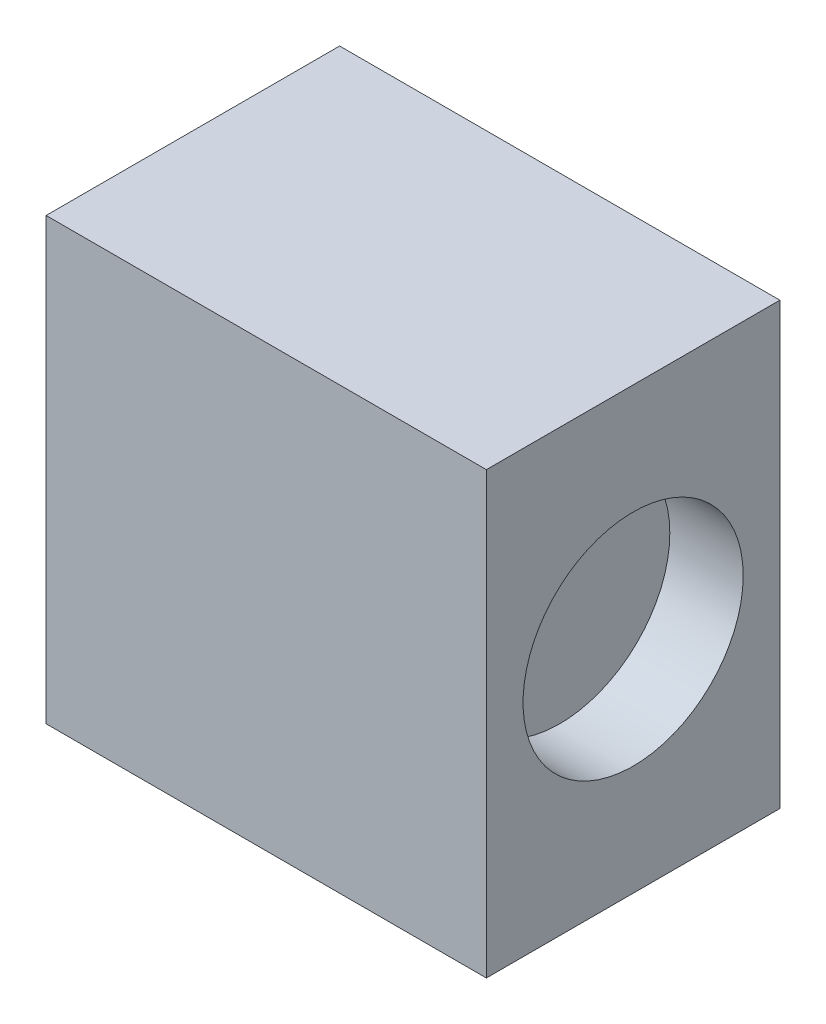
ISO-10303-21;
HEADER;
FILE_DESCRIPTION(('STEP AP214'),'2;1');
FILE_NAME('part.step','',(''),(''),'','','');
FILE_SCHEMA(('AUTOMOTIVE_DESIGN { 1 0 10303 214 1 1 1 1 }'));
ENDSEC;
DATA;
#1=APPLICATION_CONTEXT('core data for automotive mechanical design processes');
#2=APPLICATION_PROTOCOL_DEFINITION('international standard','automotive_design',2000,#1);
#3=PRODUCT_CONTEXT('',#1,'mechanical');
#4=PRODUCT('Part','Part','',(#3));
#5=PRODUCT_RELATED_PRODUCT_CATEGORY('part','',(#4));
#6=PRODUCT_DEFINITION_FORMATION('','',#4);
#7=PRODUCT_DEFINITION_CONTEXT('part definition',#1,'design');
#8=PRODUCT_DEFINITION('design','',#6,#7);
#9=PRODUCT_DEFINITION_SHAPE('','',#8);
#10=(LENGTH_UNIT() NAMED_UNIT(*) SI_UNIT(.MILLI.,.METRE.));
#11=(NAMED_UNIT(*) PLANE_ANGLE_UNIT() SI_UNIT($,.RADIAN.));
#12=(NAMED_UNIT(*) SI_UNIT($,.STERADIAN.) SOLID_ANGLE_UNIT());
#13=UNCERTAINTY_MEASURE_WITH_UNIT(LENGTH_MEASURE(1.E-05),#10,'distance_accuracy_value','');
#14=(GEOMETRIC_REPRESENTATION_CONTEXT(3) GLOBAL_UNCERTAINTY_ASSIGNED_CONTEXT((#13)) GLOBAL_UNIT_ASSIGNED_CONTEXT((#10,
#11,#12)) REPRESENTATION_CONTEXT('',''));
#15=CARTESIAN_POINT('',(0.,0.,0.));
#16=DIRECTION('',(0.,0.,1.));
#17=DIRECTION('',(1.,0.,0.));
#18=AXIS2_PLACEMENT_3D('',#15,#16,#17);
#19=CARTESIAN_POINT('',(-3.,6.,2.));
#20=DIRECTION('',(1.,0.,0.));
#21=DIRECTION('',(0.,0.,-1.));
#22=AXIS2_PLACEMENT_3D('',#19,#20,#21);
#23=PLANE('',#22);
#24=DIRECTION('',(0.,0.,1.));
#25=VECTOR('',#24,1.);
#26=CARTESIAN_POINT('',(-3.,0.,2.));
#27=LINE('',#26,#25);
#28=CARTESIAN_POINT('',(-3.,0.,-2.));
#29=VERTEX_POINT('',#28);
#30=CARTESIAN_POINT('',(-3.,0.,2.));
#31=VERTEX_POINT('',#30);
#32=EDGE_CURVE('E98',#29,#31,#27,.T.);
#33=ORIENTED_EDGE('',*,*,#32,.T.);
#34=DIRECTION('',(0.,-1.,0.));
#35=VECTOR('',#34,1.);
#36=CARTESIAN_POINT('',(-3.,6.,2.));
#37=LINE('',#36,#35);
#38=CARTESIAN_POINT('',(-3.,6.,2.));
#39=VERTEX_POINT('',#38);
#40=EDGE_CURVE('E11',#39,#31,#37,.T.);
#41=ORIENTED_EDGE('',*,*,#40,.F.);
#42=DIRECTION('',(0.,0.,1.));
#43=VECTOR('',#42,1.);
#44=CARTESIAN_POINT('',(-3.,6.,2.));
#45=LINE('',#44,#43);
#46=CARTESIAN_POINT('',(-3.,6.,-2.));
#47=VERTEX_POINT('',#46);
#48=EDGE_CURVE('E86',#47,#39,#45,.T.);
#49=ORIENTED_EDGE('',*,*,#48,.F.);
#50=DIRECTION('',(0.,-1.,0.));
#51=VECTOR('',#50,1.);
#52=CARTESIAN_POINT('',(-3.,6.,-2.));
#53=LINE('',#52,#51);
#54=EDGE_CURVE('E94',#47,#29,#53,.T.);
#55=ORIENTED_EDGE('',*,*,#54,.T.);
#56=EDGE_LOOP('',(#33,#41,#49,#55));
#57=FACE_BOUND('',#56,.T.);
#58=ADVANCED_FACE('F35',(#57),#23,.F.);
#59=CARTESIAN_POINT('',(3.,6.,2.));
#60=DIRECTION('',(0.,0.,-1.));
#61=DIRECTION('',(-1.,0.,0.));
#62=AXIS2_PLACEMENT_3D('',#59,#60,#61);
#63=PLANE('',#62);
#64=DIRECTION('',(1.,0.,0.));
#65=VECTOR('',#64,1.);
#66=CARTESIAN_POINT('',(3.,0.,2.));
#67=LINE('',#66,#65);
#68=CARTESIAN_POINT('',(3.,0.,2.));
#69=VERTEX_POINT('',#68);
#70=EDGE_CURVE('E90',#31,#69,#67,.T.);
#71=ORIENTED_EDGE('',*,*,#70,.T.);
#72=DIRECTION('',(0.,-1.,0.));
#73=VECTOR('',#72,1.);
#74=CARTESIAN_POINT('',(3.,6.,2.));
#75=LINE('',#74,#73);
#76=CARTESIAN_POINT('',(3.,6.,2.));
#77=VERTEX_POINT('',#76);
#78=EDGE_CURVE('E43',#77,#69,#75,.T.);
#79=ORIENTED_EDGE('',*,*,#78,.F.);
#80=DIRECTION('',(1.,0.,0.));
#81=VECTOR('',#80,1.);
#82=CARTESIAN_POINT('',(3.,6.,2.));
#83=LINE('',#82,#81);
#84=EDGE_CURVE('E81',#39,#77,#83,.T.);
#85=ORIENTED_EDGE('',*,*,#84,.F.);
#86=ORIENTED_EDGE('',*,*,#40,.T.);
#87=EDGE_LOOP('',(#71,#79,#85,#86));
#88=FACE_BOUND('',#87,.T.);
#89=ADVANCED_FACE('F89',(#88),#63,.F.);
#90=CARTESIAN_POINT('',(3.,6.,2.));
#91=DIRECTION('',(-1.,0.,0.));
#92=DIRECTION('',(0.,0.,1.));
#93=AXIS2_PLACEMENT_3D('',#90,#91,#92);
#94=PLANE('',#93);
#95=CARTESIAN_POINT('',(3.,3.,0.));
#96=DIRECTION('',(1.,0.,0.));
#97=DIRECTION('',(0.,0.,-1.));
#98=AXIS2_PLACEMENT_3D('',#95,#96,#97);
#99=CIRCLE('',#98,1.5);
#100=CARTESIAN_POINT('',(3.,3.,-1.5));
#101=VERTEX_POINT('',#100);
#102=EDGE_CURVE('E112',#101,#101,#99,.T.);
#103=ORIENTED_EDGE('',*,*,#102,.F.);
#104=EDGE_LOOP('',(#103));
#105=FACE_BOUND('',#104,.T.);
#106=DIRECTION('',(0.,0.,-1.));
#107=VECTOR('',#106,1.);
#108=CARTESIAN_POINT('',(3.,0.,2.));
#109=LINE('',#108,#107);
#110=CARTESIAN_POINT('',(3.,0.,-2.));
#111=VERTEX_POINT('',#110);
#112=EDGE_CURVE('E68',#69,#111,#109,.T.);
#113=ORIENTED_EDGE('',*,*,#112,.T.);
#114=DIRECTION('',(0.,-1.,0.));
#115=VECTOR('',#114,1.);
#116=CARTESIAN_POINT('',(3.,6.,-2.));
#117=LINE('',#116,#115);
#118=CARTESIAN_POINT('',(3.,6.,-2.));
#119=VERTEX_POINT('',#118);
#120=EDGE_CURVE('E91',#119,#111,#117,.T.);
#121=ORIENTED_EDGE('',*,*,#120,.F.);
#122=DIRECTION('',(0.,0.,-1.));
#123=VECTOR('',#122,1.);
#124=CARTESIAN_POINT('',(3.,6.,2.));
#125=LINE('',#124,#123);
#126=EDGE_CURVE('E84',#77,#119,#125,.T.);
#127=ORIENTED_EDGE('',*,*,#126,.F.);
#128=ORIENTED_EDGE('',*,*,#78,.T.);
#129=EDGE_LOOP('',(#113,#121,#127,#128));
#130=FACE_BOUND('',#129,.T.);
#131=ADVANCED_FACE('F92',(#105,#130),#94,.F.);
#132=CARTESIAN_POINT('',(3.,6.,-2.));
#133=DIRECTION('',(0.,0.,1.));
#134=DIRECTION('',(1.,0.,0.));
#135=AXIS2_PLACEMENT_3D('',#132,#133,#134);
#136=PLANE('',#135);
#137=DIRECTION('',(-1.,0.,0.));
#138=VECTOR('',#137,1.);
#139=CARTESIAN_POINT('',(3.,0.,-2.));
#140=LINE('',#139,#138);
#141=EDGE_CURVE('E74',#111,#29,#140,.T.);
#142=ORIENTED_EDGE('',*,*,#141,.T.);
#143=ORIENTED_EDGE('',*,*,#54,.F.);
#144=DIRECTION('',(-1.,0.,0.));
#145=VECTOR('',#144,1.);
#146=CARTESIAN_POINT('',(3.,6.,-2.));
#147=LINE('',#146,#145);
#148=EDGE_CURVE('E51',#119,#47,#147,.T.);
#149=ORIENTED_EDGE('',*,*,#148,.F.);
#150=ORIENTED_EDGE('',*,*,#120,.T.);
#151=EDGE_LOOP('',(#142,#143,#149,#150));
#152=FACE_BOUND('',#151,.T.);
#153=ADVANCED_FACE('F106',(#152),#136,.F.);
#154=CARTESIAN_POINT('',(0.,6.,0.));
#155=DIRECTION('',(0.,1.,0.));
#156=DIRECTION('',(0.,0.,1.));
#157=AXIS2_PLACEMENT_3D('',#154,#155,#156);
#158=PLANE('',#157);
#159=ORIENTED_EDGE('',*,*,#48,.T.);
#160=ORIENTED_EDGE('',*,*,#84,.T.);
#161=ORIENTED_EDGE('',*,*,#126,.T.);
#162=ORIENTED_EDGE('',*,*,#148,.T.);
#163=EDGE_LOOP('',(#159,#160,#161,#162));
#164=FACE_BOUND('',#163,.T.);
#165=ADVANCED_FACE('F82',(#164),#158,.T.);
#166=CARTESIAN_POINT('',(0.,0.,0.));
#167=DIRECTION('',(0.,1.,0.));
#168=DIRECTION('',(0.,0.,1.));
#169=AXIS2_PLACEMENT_3D('',#166,#167,#168);
#170=PLANE('',#169);
#171=ORIENTED_EDGE('',*,*,#32,.F.);
#172=ORIENTED_EDGE('',*,*,#141,.F.);
#173=ORIENTED_EDGE('',*,*,#112,.F.);
#174=ORIENTED_EDGE('',*,*,#70,.F.);
#175=EDGE_LOOP('',(#171,#172,#173,#174));
#176=FACE_BOUND('',#175,.T.);
#177=ADVANCED_FACE('F109',(#176),#170,.F.);
#178=CARTESIAN_POINT('',(2.,3.,0.));
#179=DIRECTION('',(1.,0.,0.));
#180=DIRECTION('',(0.,0.,-1.));
#181=AXIS2_PLACEMENT_3D('',#178,#179,#180);
#182=CYLINDRICAL_SURFACE('',#181,1.5);
#183=CARTESIAN_POINT('',(2.,3.,0.));
#184=DIRECTION('',(1.,0.,0.));
#185=DIRECTION('',(0.,0.,-1.));
#186=AXIS2_PLACEMENT_3D('',#183,#184,#185);
#187=CIRCLE('',#186,1.5);
#188=CARTESIAN_POINT('',(2.,3.,-1.5));
#189=VERTEX_POINT('',#188);
#190=EDGE_CURVE('E101',#189,#189,#187,.T.);
#191=ORIENTED_EDGE('',*,*,#190,.F.);
#192=EDGE_LOOP('',(#191));
#193=FACE_BOUND('',#192,.T.);
#194=ORIENTED_EDGE('',*,*,#102,.T.);
#195=EDGE_LOOP('',(#194));
#196=FACE_BOUND('',#195,.T.);
#197=ADVANCED_FACE('F120',(#193,#196),#182,.F.);
#198=CARTESIAN_POINT('',(2.,3.,0.));
#199=DIRECTION('',(1.,0.,0.));
#200=DIRECTION('',(0.,0.,-1.));
#201=AXIS2_PLACEMENT_3D('',#198,#199,#200);
#202=PLANE('',#201);
#203=ORIENTED_EDGE('',*,*,#190,.T.);
#204=EDGE_LOOP('',(#203));
#205=FACE_BOUND('',#204,.T.);
#206=ADVANCED_FACE('F118',(#205),#202,.T.);
#207=CLOSED_SHELL('',(#58,#89,#131,#153,#165,#177,#197,#206));
#208=MANIFOLD_SOLID_BREP('B2',#207);
#209=ADVANCED_BREP_SHAPE_REPRESENTATION('',(#18,#208),#14);
#210=SHAPE_DEFINITION_REPRESENTATION(#9,#209);
ENDSEC;
END-ISO-10303-21;
